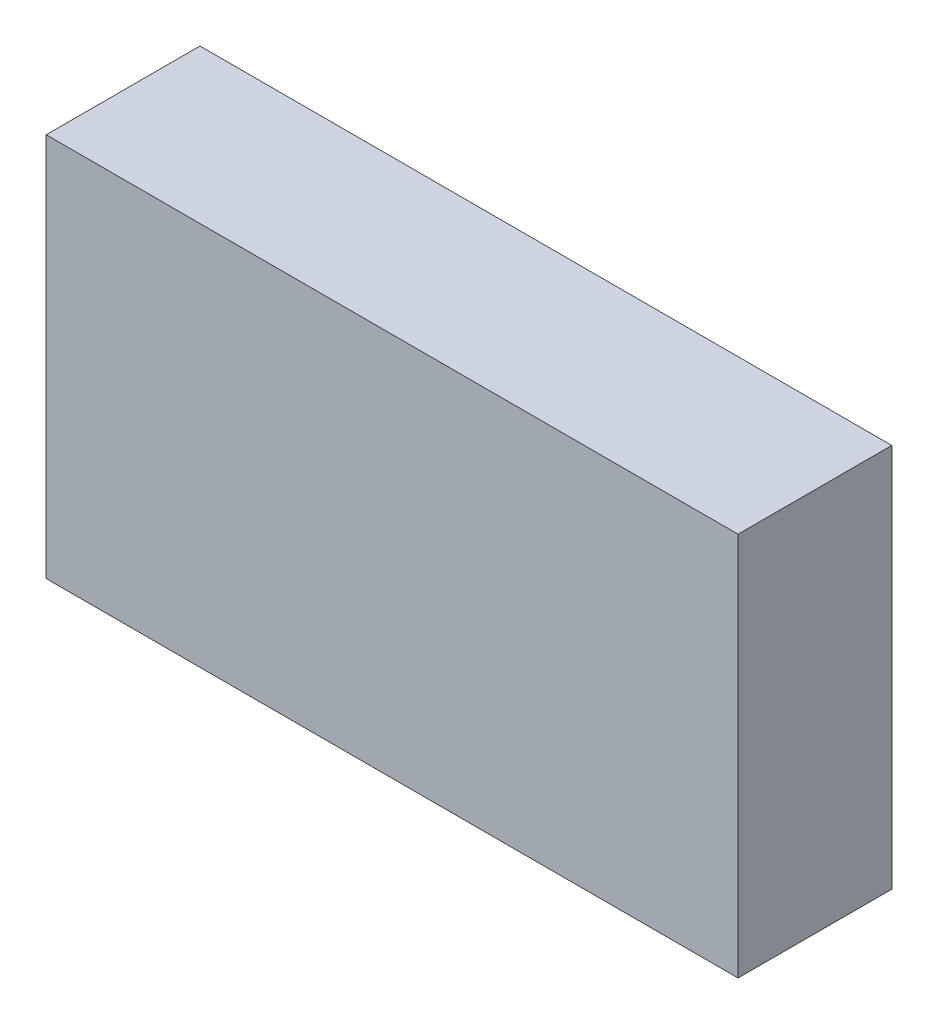
ISO-10303-21;
HEADER;
FILE_DESCRIPTION(('STEP AP214'),'2;1');
FILE_NAME('part.step','',(''),(''),'','','');
FILE_SCHEMA(('AUTOMOTIVE_DESIGN { 1 0 10303 214 1 1 1 1 }'));
ENDSEC;
DATA;
#1=APPLICATION_CONTEXT('core data for automotive mechanical design processes');
#2=APPLICATION_PROTOCOL_DEFINITION('international standard','automotive_design',2000,#1);
#3=PRODUCT_CONTEXT('',#1,'mechanical');
#4=PRODUCT('Part','Part','',(#3));
#5=PRODUCT_RELATED_PRODUCT_CATEGORY('part','',(#4));
#6=PRODUCT_DEFINITION_FORMATION('','',#4);
#7=PRODUCT_DEFINITION_CONTEXT('part definition',#1,'design');
#8=PRODUCT_DEFINITION('design','',#6,#7);
#9=PRODUCT_DEFINITION_SHAPE('','',#8);
#10=(LENGTH_UNIT() NAMED_UNIT(*) SI_UNIT(.MILLI.,.METRE.));
#11=(NAMED_UNIT(*) PLANE_ANGLE_UNIT() SI_UNIT($,.RADIAN.));
#12=(NAMED_UNIT(*) SI_UNIT($,.STERADIAN.) SOLID_ANGLE_UNIT());
#13=UNCERTAINTY_MEASURE_WITH_UNIT(LENGTH_MEASURE(1.E-05),#10,'distance_accuracy_value','');
#14=(GEOMETRIC_REPRESENTATION_CONTEXT(3) GLOBAL_UNCERTAINTY_ASSIGNED_CONTEXT((#13)) GLOBAL_UNIT_ASSIGNED_CONTEXT((#10,
#11,#12)) REPRESENTATION_CONTEXT('',''));
#15=CARTESIAN_POINT('',(0.,0.,0.));
#16=DIRECTION('',(0.,0.,1.));
#17=DIRECTION('',(1.,0.,0.));
#18=AXIS2_PLACEMENT_3D('',#15,#16,#17);
#19=CARTESIAN_POINT('',(-2.05,0.875,0.));
#20=DIRECTION('',(1.,0.,0.));
#21=DIRECTION('',(0.,0.,1.));
#22=AXIS2_PLACEMENT_3D('',#19,#20,#21);
#23=PLANE('',#22);
#24=DIRECTION('',(0.,1.,0.));
#25=VECTOR('',#24,1.);
#26=CARTESIAN_POINT('',(-2.05,0.875,0.1));
#27=LINE('',#26,#25);
#28=CARTESIAN_POINT('',(-2.05,0.875,0.1));
#29=VERTEX_POINT('',#28);
#30=CARTESIAN_POINT('',(-2.05,1.125,0.1));
#31=VERTEX_POINT('',#30);
#32=EDGE_CURVE('E11',#29,#31,#27,.T.);
#33=ORIENTED_EDGE('',*,*,#32,.T.);
#34=DIRECTION('',(0.,0.,1.));
#35=VECTOR('',#34,1.);
#36=CARTESIAN_POINT('',(-2.05,1.125,0.));
#37=LINE('',#36,#35);
#38=CARTESIAN_POINT('',(-2.05,1.125,0.));
#39=VERTEX_POINT('',#38);
#40=EDGE_CURVE('E24',#39,#31,#37,.T.);
#41=ORIENTED_EDGE('',*,*,#40,.F.);
#42=DIRECTION('',(0.,1.,0.));
#43=VECTOR('',#42,1.);
#44=CARTESIAN_POINT('',(-2.05,0.875,0.));
#45=LINE('',#44,#43);
#46=CARTESIAN_POINT('',(-2.05,0.875,0.));
#47=VERTEX_POINT('',#46);
#48=EDGE_CURVE('E86',#47,#39,#45,.T.);
#49=ORIENTED_EDGE('',*,*,#48,.F.);
#50=DIRECTION('',(0.,0.,1.));
#51=VECTOR('',#50,1.);
#52=CARTESIAN_POINT('',(-2.05,0.875,0.));
#53=LINE('',#52,#51);
#54=EDGE_CURVE('E36',#47,#29,#53,.T.);
#55=ORIENTED_EDGE('',*,*,#54,.T.);
#56=EDGE_LOOP('',(#33,#41,#49,#55));
#57=FACE_BOUND('',#56,.T.);
#58=ADVANCED_FACE('F17',(#57),#23,.F.);
#59=CARTESIAN_POINT('',(-1.6,0.875,0.));
#60=DIRECTION('',(1.,0.,0.));
#61=DIRECTION('',(0.,0.,1.));
#62=AXIS2_PLACEMENT_3D('',#59,#60,#61);
#63=PLANE('',#62);
#64=DIRECTION('',(0.,0.,1.));
#65=VECTOR('',#64,1.);
#66=CARTESIAN_POINT('',(-1.6,0.875,0.));
#67=LINE('',#66,#65);
#68=CARTESIAN_POINT('',(-1.6,0.875,0.));
#69=VERTEX_POINT('',#68);
#70=CARTESIAN_POINT('',(-1.6,0.875,0.1));
#71=VERTEX_POINT('',#70);
#72=EDGE_CURVE('E83',#69,#71,#67,.T.);
#73=ORIENTED_EDGE('',*,*,#72,.F.);
#74=DIRECTION('',(0.,1.,0.));
#75=VECTOR('',#74,1.);
#76=CARTESIAN_POINT('',(-1.6,0.875,0.));
#77=LINE('',#76,#75);
#78=CARTESIAN_POINT('',(-1.6,1.125,0.));
#79=VERTEX_POINT('',#78);
#80=EDGE_CURVE('E63',#69,#79,#77,.T.);
#81=ORIENTED_EDGE('',*,*,#80,.T.);
#82=DIRECTION('',(0.,0.,1.));
#83=VECTOR('',#82,1.);
#84=CARTESIAN_POINT('',(-1.6,1.125,0.));
#85=LINE('',#84,#83);
#86=CARTESIAN_POINT('',(-1.6,1.125,0.1));
#87=VERTEX_POINT('',#86);
#88=EDGE_CURVE('E57',#79,#87,#85,.T.);
#89=ORIENTED_EDGE('',*,*,#88,.T.);
#90=DIRECTION('',(0.,1.,0.));
#91=VECTOR('',#90,1.);
#92=CARTESIAN_POINT('',(-1.6,0.875,0.1));
#93=LINE('',#92,#91);
#94=EDGE_CURVE('E60',#71,#87,#93,.T.);
#95=ORIENTED_EDGE('',*,*,#94,.F.);
#96=EDGE_LOOP('',(#73,#81,#89,#95));
#97=FACE_BOUND('',#96,.T.);
#98=ADVANCED_FACE('F59',(#97),#63,.T.);
#99=CARTESIAN_POINT('',(-2.05,0.875,0.));
#100=DIRECTION('',(0.,1.,0.));
#101=DIRECTION('',(0.,0.,1.));
#102=AXIS2_PLACEMENT_3D('',#99,#100,#101);
#103=PLANE('',#102);
#104=ORIENTED_EDGE('',*,*,#72,.T.);
#105=DIRECTION('',(1.,0.,0.));
#106=VECTOR('',#105,1.);
#107=CARTESIAN_POINT('',(-2.05,0.875,0.1));
#108=LINE('',#107,#106);
#109=EDGE_CURVE('E71',#29,#71,#108,.T.);
#110=ORIENTED_EDGE('',*,*,#109,.F.);
#111=ORIENTED_EDGE('',*,*,#54,.F.);
#112=DIRECTION('',(1.,0.,0.));
#113=VECTOR('',#112,1.);
#114=CARTESIAN_POINT('',(-2.05,0.875,0.));
#115=LINE('',#114,#113);
#116=EDGE_CURVE('E76',#47,#69,#115,.T.);
#117=ORIENTED_EDGE('',*,*,#116,.T.);
#118=EDGE_LOOP('',(#104,#110,#111,#117));
#119=FACE_BOUND('',#118,.T.);
#120=ADVANCED_FACE('F91',(#119),#103,.F.);
#121=CARTESIAN_POINT('',(-2.05,1.125,0.));
#122=DIRECTION('',(0.,1.,0.));
#123=DIRECTION('',(0.,0.,1.));
#124=AXIS2_PLACEMENT_3D('',#121,#122,#123);
#125=PLANE('',#124);
#126=DIRECTION('',(1.,0.,0.));
#127=VECTOR('',#126,1.);
#128=CARTESIAN_POINT('',(-2.05,1.125,0.));
#129=LINE('',#128,#127);
#130=EDGE_CURVE('E74',#39,#79,#129,.T.);
#131=ORIENTED_EDGE('',*,*,#130,.F.);
#132=ORIENTED_EDGE('',*,*,#40,.T.);
#133=DIRECTION('',(1.,0.,0.));
#134=VECTOR('',#133,1.);
#135=CARTESIAN_POINT('',(-2.05,1.125,0.1));
#136=LINE('',#135,#134);
#137=EDGE_CURVE('E69',#31,#87,#136,.T.);
#138=ORIENTED_EDGE('',*,*,#137,.T.);
#139=ORIENTED_EDGE('',*,*,#88,.F.);
#140=EDGE_LOOP('',(#131,#132,#138,#139));
#141=FACE_BOUND('',#140,.T.);
#142=ADVANCED_FACE('F73',(#141),#125,.T.);
#143=CARTESIAN_POINT('',(-2.05,0.875,0.));
#144=DIRECTION('',(0.,0.,1.));
#145=DIRECTION('',(1.,0.,0.));
#146=AXIS2_PLACEMENT_3D('',#143,#144,#145);
#147=PLANE('',#146);
#148=ORIENTED_EDGE('',*,*,#130,.T.);
#149=ORIENTED_EDGE('',*,*,#80,.F.);
#150=ORIENTED_EDGE('',*,*,#116,.F.);
#151=ORIENTED_EDGE('',*,*,#48,.T.);
#152=EDGE_LOOP('',(#148,#149,#150,#151));
#153=FACE_BOUND('',#152,.T.);
#154=ADVANCED_FACE('F89',(#153),#147,.F.);
#155=CARTESIAN_POINT('',(-2.05,0.875,0.1));
#156=DIRECTION('',(0.,0.,1.));
#157=DIRECTION('',(1.,0.,0.));
#158=AXIS2_PLACEMENT_3D('',#155,#156,#157);
#159=PLANE('',#158);
#160=ORIENTED_EDGE('',*,*,#32,.F.);
#161=ORIENTED_EDGE('',*,*,#109,.T.);
#162=ORIENTED_EDGE('',*,*,#94,.T.);
#163=ORIENTED_EDGE('',*,*,#137,.F.);
#164=EDGE_LOOP('',(#160,#161,#162,#163));
#165=FACE_BOUND('',#164,.T.);
#166=ADVANCED_FACE('F68',(#165),#159,.T.);
#167=CLOSED_SHELL('',(#58,#98,#120,#142,#154,#166));
#168=MANIFOLD_SOLID_BREP('B1',#167);
#169=ADVANCED_BREP_SHAPE_REPRESENTATION('',(#18,#168),#14);
#170=SHAPE_DEFINITION_REPRESENTATION(#9,#169);
ENDSEC;
END-ISO-10303-21;
